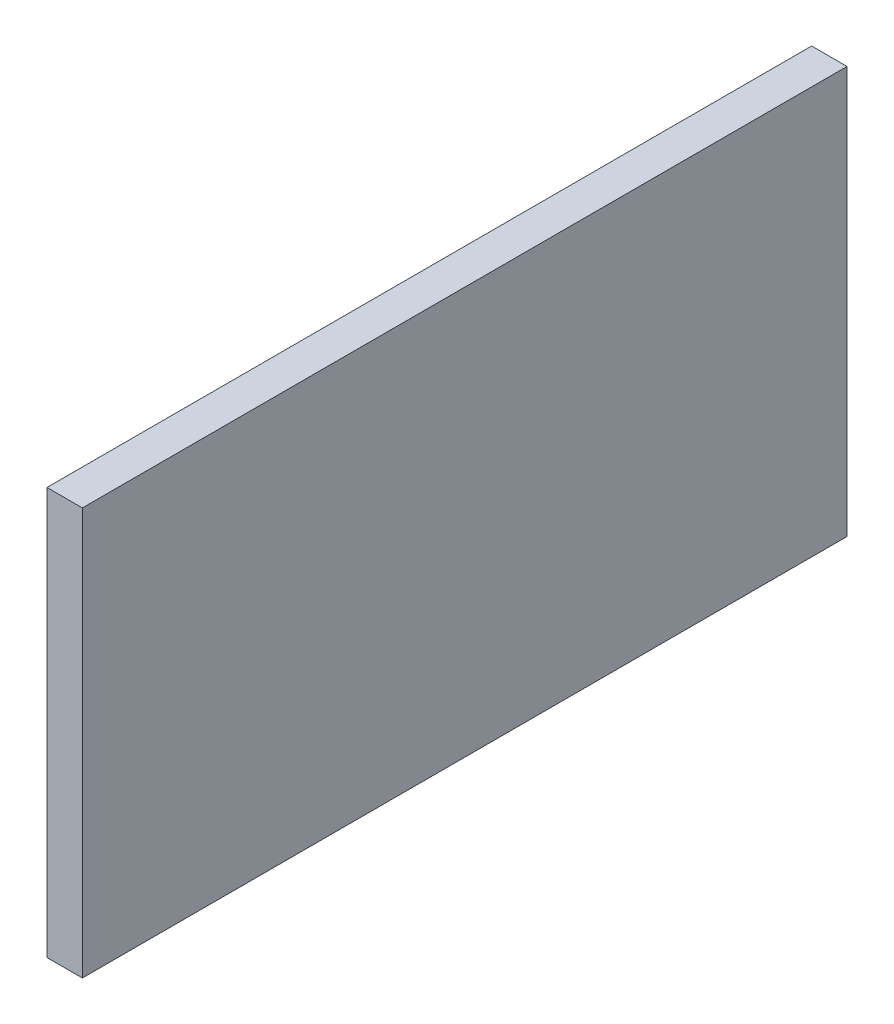
ISO-10303-21;
HEADER;
FILE_DESCRIPTION(('STEP AP214'),'2;1');
FILE_NAME('part.step','',(''),(''),'','','');
FILE_SCHEMA(('AUTOMOTIVE_DESIGN { 1 0 10303 214 1 1 1 1 }'));
ENDSEC;
DATA;
#1=APPLICATION_CONTEXT('core data for automotive mechanical design processes');
#2=APPLICATION_PROTOCOL_DEFINITION('international standard','automotive_design',2000,#1);
#3=PRODUCT_CONTEXT('',#1,'mechanical');
#4=PRODUCT('Part','Part','',(#3));
#5=PRODUCT_RELATED_PRODUCT_CATEGORY('part','',(#4));
#6=PRODUCT_DEFINITION_FORMATION('','',#4);
#7=PRODUCT_DEFINITION_CONTEXT('part definition',#1,'design');
#8=PRODUCT_DEFINITION('design','',#6,#7);
#9=PRODUCT_DEFINITION_SHAPE('','',#8);
#10=(LENGTH_UNIT() NAMED_UNIT(*) SI_UNIT(.MILLI.,.METRE.));
#11=(NAMED_UNIT(*) PLANE_ANGLE_UNIT() SI_UNIT($,.RADIAN.));
#12=(NAMED_UNIT(*) SI_UNIT($,.STERADIAN.) SOLID_ANGLE_UNIT());
#13=UNCERTAINTY_MEASURE_WITH_UNIT(LENGTH_MEASURE(1.E-05),#10,'distance_accuracy_value','');
#14=(GEOMETRIC_REPRESENTATION_CONTEXT(3) GLOBAL_UNCERTAINTY_ASSIGNED_CONTEXT((#13)) GLOBAL_UNIT_ASSIGNED_CONTEXT((#10,
#11,#12)) REPRESENTATION_CONTEXT('',''));
#15=CARTESIAN_POINT('',(0.,0.,0.));
#16=DIRECTION('',(0.,0.,1.));
#17=DIRECTION('',(1.,0.,0.));
#18=AXIS2_PLACEMENT_3D('',#15,#16,#17);
#19=CARTESIAN_POINT('',(3.175,-18.25625,-34.29));
#20=DIRECTION('',(0.,0.,1.));
#21=DIRECTION('',(1.,0.,0.));
#22=AXIS2_PLACEMENT_3D('',#19,#20,#21);
#23=PLANE('',#22);
#24=DIRECTION('',(0.,1.,0.));
#25=VECTOR('',#24,1.);
#26=CARTESIAN_POINT('',(0.,-18.25625,-34.29));
#27=LINE('',#26,#25);
#28=CARTESIAN_POINT('',(0.,-18.25625,-34.29));
#29=VERTEX_POINT('',#28);
#30=CARTESIAN_POINT('',(0.,18.25625,-34.29));
#31=VERTEX_POINT('',#30);
#32=EDGE_CURVE('E96',#29,#31,#27,.T.);
#33=ORIENTED_EDGE('',*,*,#32,.T.);
#34=DIRECTION('',(-1.,0.,0.));
#35=VECTOR('',#34,1.);
#36=CARTESIAN_POINT('',(3.175,18.25625,-34.29));
#37=LINE('',#36,#35);
#38=CARTESIAN_POINT('',(3.175,18.25625,-34.29));
#39=VERTEX_POINT('',#38);
#40=EDGE_CURVE('E11',#39,#31,#37,.T.);
#41=ORIENTED_EDGE('',*,*,#40,.F.);
#42=DIRECTION('',(0.,1.,0.));
#43=VECTOR('',#42,1.);
#44=CARTESIAN_POINT('',(3.175,-18.25625,-34.29));
#45=LINE('',#44,#43);
#46=CARTESIAN_POINT('',(3.175,-18.25625,-34.29));
#47=VERTEX_POINT('',#46);
#48=EDGE_CURVE('E84',#47,#39,#45,.T.);
#49=ORIENTED_EDGE('',*,*,#48,.F.);
#50=DIRECTION('',(-1.,0.,0.));
#51=VECTOR('',#50,1.);
#52=CARTESIAN_POINT('',(3.175,-18.25625,-34.29));
#53=LINE('',#52,#51);
#54=EDGE_CURVE('E92',#47,#29,#53,.T.);
#55=ORIENTED_EDGE('',*,*,#54,.T.);
#56=EDGE_LOOP('',(#33,#41,#49,#55));
#57=FACE_BOUND('',#56,.T.);
#58=ADVANCED_FACE('F33',(#57),#23,.F.);
#59=CARTESIAN_POINT('',(3.175,18.25625,34.29));
#60=DIRECTION('',(0.,-1.,0.));
#61=DIRECTION('',(0.,0.,-1.));
#62=AXIS2_PLACEMENT_3D('',#59,#60,#61);
#63=PLANE('',#62);
#64=DIRECTION('',(0.,0.,1.));
#65=VECTOR('',#64,1.);
#66=CARTESIAN_POINT('',(0.,18.25625,34.29));
#67=LINE('',#66,#65);
#68=CARTESIAN_POINT('',(0.,18.25625,34.29));
#69=VERTEX_POINT('',#68);
#70=EDGE_CURVE('E88',#31,#69,#67,.T.);
#71=ORIENTED_EDGE('',*,*,#70,.T.);
#72=DIRECTION('',(-1.,0.,0.));
#73=VECTOR('',#72,1.);
#74=CARTESIAN_POINT('',(3.175,18.25625,34.29));
#75=LINE('',#74,#73);
#76=CARTESIAN_POINT('',(3.175,18.25625,34.29));
#77=VERTEX_POINT('',#76);
#78=EDGE_CURVE('E41',#77,#69,#75,.T.);
#79=ORIENTED_EDGE('',*,*,#78,.F.);
#80=DIRECTION('',(0.,0.,1.));
#81=VECTOR('',#80,1.);
#82=CARTESIAN_POINT('',(3.175,18.25625,34.29));
#83=LINE('',#82,#81);
#84=EDGE_CURVE('E79',#39,#77,#83,.T.);
#85=ORIENTED_EDGE('',*,*,#84,.F.);
#86=ORIENTED_EDGE('',*,*,#40,.T.);
#87=EDGE_LOOP('',(#71,#79,#85,#86));
#88=FACE_BOUND('',#87,.T.);
#89=ADVANCED_FACE('F87',(#88),#63,.F.);
#90=CARTESIAN_POINT('',(3.175,-18.25625,34.29));
#91=DIRECTION('',(0.,0.,-1.));
#92=DIRECTION('',(-1.,0.,0.));
#93=AXIS2_PLACEMENT_3D('',#90,#91,#92);
#94=PLANE('',#93);
#95=DIRECTION('',(0.,-1.,0.));
#96=VECTOR('',#95,1.);
#97=CARTESIAN_POINT('',(0.,-18.25625,34.29));
#98=LINE('',#97,#96);
#99=CARTESIAN_POINT('',(0.,-18.25625,34.29));
#100=VERTEX_POINT('',#99);
#101=EDGE_CURVE('E66',#69,#100,#98,.T.);
#102=ORIENTED_EDGE('',*,*,#101,.T.);
#103=DIRECTION('',(-1.,0.,0.));
#104=VECTOR('',#103,1.);
#105=CARTESIAN_POINT('',(3.175,-18.25625,34.29));
#106=LINE('',#105,#104);
#107=CARTESIAN_POINT('',(3.175,-18.25625,34.29));
#108=VERTEX_POINT('',#107);
#109=EDGE_CURVE('E89',#108,#100,#106,.T.);
#110=ORIENTED_EDGE('',*,*,#109,.F.);
#111=DIRECTION('',(0.,-1.,0.));
#112=VECTOR('',#111,1.);
#113=CARTESIAN_POINT('',(3.175,-18.25625,34.29));
#114=LINE('',#113,#112);
#115=EDGE_CURVE('E82',#77,#108,#114,.T.);
#116=ORIENTED_EDGE('',*,*,#115,.F.);
#117=ORIENTED_EDGE('',*,*,#78,.T.);
#118=EDGE_LOOP('',(#102,#110,#116,#117));
#119=FACE_BOUND('',#118,.T.);
#120=ADVANCED_FACE('F90',(#119),#94,.F.);
#121=CARTESIAN_POINT('',(3.175,-18.25625,34.29));
#122=DIRECTION('',(0.,1.,0.));
#123=DIRECTION('',(0.,0.,1.));
#124=AXIS2_PLACEMENT_3D('',#121,#122,#123);
#125=PLANE('',#124);
#126=DIRECTION('',(0.,0.,-1.));
#127=VECTOR('',#126,1.);
#128=CARTESIAN_POINT('',(0.,-18.25625,34.29));
#129=LINE('',#128,#127);
#130=EDGE_CURVE('E72',#100,#29,#129,.T.);
#131=ORIENTED_EDGE('',*,*,#130,.T.);
#132=ORIENTED_EDGE('',*,*,#54,.F.);
#133=DIRECTION('',(0.,0.,-1.));
#134=VECTOR('',#133,1.);
#135=CARTESIAN_POINT('',(3.175,-18.25625,34.29));
#136=LINE('',#135,#134);
#137=EDGE_CURVE('E49',#108,#47,#136,.T.);
#138=ORIENTED_EDGE('',*,*,#137,.F.);
#139=ORIENTED_EDGE('',*,*,#109,.T.);
#140=EDGE_LOOP('',(#131,#132,#138,#139));
#141=FACE_BOUND('',#140,.T.);
#142=ADVANCED_FACE('F103',(#141),#125,.F.);
#143=CARTESIAN_POINT('',(3.175,18.25625,-34.29));
#144=DIRECTION('',(-1.,0.,0.));
#145=DIRECTION('',(0.,0.,1.));
#146=AXIS2_PLACEMENT_3D('',#143,#144,#145);
#147=PLANE('',#146);
#148=ORIENTED_EDGE('',*,*,#48,.T.);
#149=ORIENTED_EDGE('',*,*,#84,.T.);
#150=ORIENTED_EDGE('',*,*,#115,.T.);
#151=ORIENTED_EDGE('',*,*,#137,.T.);
#152=EDGE_LOOP('',(#148,#149,#150,#151));
#153=FACE_BOUND('',#152,.T.);
#154=ADVANCED_FACE('F80',(#153),#147,.F.);
#155=CARTESIAN_POINT('',(0.,18.25625,-34.29));
#156=DIRECTION('',(-1.,0.,0.));
#157=DIRECTION('',(0.,0.,1.));
#158=AXIS2_PLACEMENT_3D('',#155,#156,#157);
#159=PLANE('',#158);
#160=ORIENTED_EDGE('',*,*,#32,.F.);
#161=ORIENTED_EDGE('',*,*,#130,.F.);
#162=ORIENTED_EDGE('',*,*,#101,.F.);
#163=ORIENTED_EDGE('',*,*,#70,.F.);
#164=EDGE_LOOP('',(#160,#161,#162,#163));
#165=FACE_BOUND('',#164,.T.);
#166=ADVANCED_FACE('F106',(#165),#159,.T.);
#167=CLOSED_SHELL('',(#58,#89,#120,#142,#154,#166));
#168=MANIFOLD_SOLID_BREP('B2',#167);
#169=ADVANCED_BREP_SHAPE_REPRESENTATION('',(#18,#168),#14);
#170=SHAPE_DEFINITION_REPRESENTATION(#9,#169);
ENDSEC;
END-ISO-10303-21;
